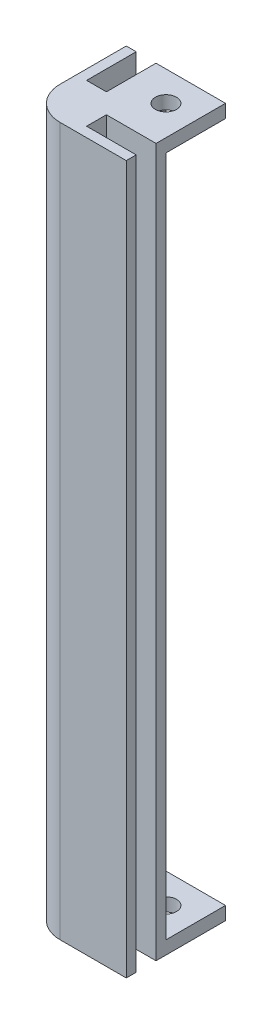
ISO-10303-21;
HEADER;
FILE_DESCRIPTION(('STEP AP214'),'2;1');
FILE_NAME('part.step','',(''),(''),'','','');
FILE_SCHEMA(('AUTOMOTIVE_DESIGN { 1 0 10303 214 1 1 1 1 }'));
ENDSEC;
DATA;
#1=APPLICATION_CONTEXT('core data for automotive mechanical design processes');
#2=APPLICATION_PROTOCOL_DEFINITION('international standard','automotive_design',2000,#1);
#3=PRODUCT_CONTEXT('',#1,'mechanical');
#4=PRODUCT('Part','Part','',(#3));
#5=PRODUCT_RELATED_PRODUCT_CATEGORY('part','',(#4));
#6=PRODUCT_DEFINITION_FORMATION('','',#4);
#7=PRODUCT_DEFINITION_CONTEXT('part definition',#1,'design');
#8=PRODUCT_DEFINITION('design','',#6,#7);
#9=PRODUCT_DEFINITION_SHAPE('','',#8);
#10=(LENGTH_UNIT() NAMED_UNIT(*) SI_UNIT(.MILLI.,.METRE.));
#11=(NAMED_UNIT(*) PLANE_ANGLE_UNIT() SI_UNIT($,.RADIAN.));
#12=(NAMED_UNIT(*) SI_UNIT($,.STERADIAN.) SOLID_ANGLE_UNIT());
#13=UNCERTAINTY_MEASURE_WITH_UNIT(LENGTH_MEASURE(1.E-05),#10,'distance_accuracy_value','');
#14=(GEOMETRIC_REPRESENTATION_CONTEXT(3) GLOBAL_UNCERTAINTY_ASSIGNED_CONTEXT((#13)) GLOBAL_UNIT_ASSIGNED_CONTEXT((#10,
#11,#12)) REPRESENTATION_CONTEXT('',''));
#15=CARTESIAN_POINT('',(0.,0.,0.));
#16=DIRECTION('',(0.,0.,1.));
#17=DIRECTION('',(1.,0.,0.));
#18=AXIS2_PLACEMENT_3D('',#15,#16,#17);
#19=CARTESIAN_POINT('',(-7.49999999999998,105.,7.50000000000001));
#20=DIRECTION('',(1.,0.,0.));
#21=DIRECTION('',(0.,0.,-1.));
#22=AXIS2_PLACEMENT_3D('',#19,#20,#21);
#23=PLANE('',#22);
#24=DIRECTION('',(0.,0.,-1.));
#25=VECTOR('',#24,1.);
#26=CARTESIAN_POINT('',(-7.49999999999999,-2.,0.));
#27=LINE('',#26,#25);
#28=CARTESIAN_POINT('',(-7.49999999999999,-2.,2.50000000000002));
#29=VERTEX_POINT('',#28);
#30=CARTESIAN_POINT('',(-7.50000000000001,-2.,-7.49999999999999));
#31=VERTEX_POINT('',#30);
#32=EDGE_CURVE('E293',#29,#31,#27,.T.);
#33=ORIENTED_EDGE('',*,*,#32,.F.);
#34=DIRECTION('',(0.,-1.,0.));
#35=VECTOR('',#34,1.);
#36=CARTESIAN_POINT('',(-7.49999999999999,105.,2.50000000000002));
#37=LINE('',#36,#35);
#38=CARTESIAN_POINT('',(-7.49999999999999,105.,2.50000000000002));
#39=VERTEX_POINT('',#38);
#40=EDGE_CURVE('E185',#29,#39,#37,.F.);
#41=ORIENTED_EDGE('',*,*,#40,.T.);
#42=DIRECTION('',(0.,0.,1.));
#43=VECTOR('',#42,1.);
#44=CARTESIAN_POINT('',(-7.49999999999998,105.,7.50000000000001));
#45=LINE('',#44,#43);
#46=CARTESIAN_POINT('',(-7.50000000000001,105.,-7.49999999999999));
#47=VERTEX_POINT('',#46);
#48=EDGE_CURVE('E221',#47,#39,#45,.T.);
#49=ORIENTED_EDGE('',*,*,#48,.F.);
#50=DIRECTION('',(0.,-1.,0.));
#51=VECTOR('',#50,1.);
#52=CARTESIAN_POINT('',(-7.50000000000001,105.,-7.49999999999999));
#53=LINE('',#52,#51);
#54=EDGE_CURVE('E215',#47,#31,#53,.T.);
#55=ORIENTED_EDGE('',*,*,#54,.T.);
#56=EDGE_LOOP('',(#33,#41,#49,#55));
#57=FACE_BOUND('',#56,.T.);
#58=ADVANCED_FACE('F42',(#57),#23,.F.);
#59=CARTESIAN_POINT('',(-7.49999999999998,105.,7.50000000000001));
#60=DIRECTION('',(0.,0.,-1.));
#61=DIRECTION('',(-1.,0.,0.));
#62=AXIS2_PLACEMENT_3D('',#59,#60,#61);
#63=PLANE('',#62);
#64=DIRECTION('',(1.,0.,0.));
#65=VECTOR('',#64,1.);
#66=CARTESIAN_POINT('',(-7.49999999999998,105.,7.50000000000001));
#67=LINE('',#66,#65);
#68=CARTESIAN_POINT('',(-2.49999999999999,105.,7.50000000000001));
#69=VERTEX_POINT('',#68);
#70=CARTESIAN_POINT('',(7.50000000000002,105.,7.50000000000001));
#71=VERTEX_POINT('',#70);
#72=EDGE_CURVE('E245',#69,#71,#67,.T.);
#73=ORIENTED_EDGE('',*,*,#72,.F.);
#74=DIRECTION('',(0.,-1.,0.));
#75=VECTOR('',#74,1.);
#76=CARTESIAN_POINT('',(-2.49999999999999,105.,7.50000000000001));
#77=LINE('',#76,#75);
#78=CARTESIAN_POINT('',(-2.49999999999999,-2.,7.50000000000001));
#79=VERTEX_POINT('',#78);
#80=EDGE_CURVE('E191',#69,#79,#77,.T.);
#81=ORIENTED_EDGE('',*,*,#80,.T.);
#82=DIRECTION('',(-1.,0.,0.));
#83=VECTOR('',#82,1.);
#84=CARTESIAN_POINT('',(0.,-2.,7.50000000000001));
#85=LINE('',#84,#83);
#86=CARTESIAN_POINT('',(7.50000000000002,-2.,7.50000000000001));
#87=VERTEX_POINT('',#86);
#88=EDGE_CURVE('E255',#87,#79,#85,.T.);
#89=ORIENTED_EDGE('',*,*,#88,.F.);
#90=DIRECTION('',(0.,-1.,0.));
#91=VECTOR('',#90,1.);
#92=CARTESIAN_POINT('',(7.50000000000002,105.,7.50000000000001));
#93=LINE('',#92,#91);
#94=EDGE_CURVE('E194',#71,#87,#93,.T.);
#95=ORIENTED_EDGE('',*,*,#94,.F.);
#96=EDGE_LOOP('',(#73,#81,#89,#95));
#97=FACE_BOUND('',#96,.T.);
#98=ADVANCED_FACE('F335',(#97),#63,.F.);
#99=CARTESIAN_POINT('',(7.50000000000002,105.,7.50000000000001));
#100=DIRECTION('',(-1.,0.,0.));
#101=DIRECTION('',(0.,0.,1.));
#102=AXIS2_PLACEMENT_3D('',#99,#100,#101);
#103=PLANE('',#102);
#104=ORIENTED_EDGE('',*,*,#94,.T.);
#105=DIRECTION('',(0.,0.,1.));
#106=VECTOR('',#105,1.);
#107=CARTESIAN_POINT('',(7.50000000000002,-2.,0.));
#108=LINE('',#107,#106);
#109=CARTESIAN_POINT('',(7.50000000000002,-2.,6.00000000000001));
#110=VERTEX_POINT('',#109);
#111=EDGE_CURVE('E264',#110,#87,#108,.T.);
#112=ORIENTED_EDGE('',*,*,#111,.F.);
#113=DIRECTION('',(0.,-1.,0.));
#114=VECTOR('',#113,1.);
#115=CARTESIAN_POINT('',(7.50000000000002,105.,6.00000000000001));
#116=LINE('',#115,#114);
#117=CARTESIAN_POINT('',(7.50000000000002,105.,6.00000000000001));
#118=VERTEX_POINT('',#117);
#119=EDGE_CURVE('E196',#118,#110,#116,.T.);
#120=ORIENTED_EDGE('',*,*,#119,.F.);
#121=DIRECTION('',(0.,0.,-1.));
#122=VECTOR('',#121,1.);
#123=CARTESIAN_POINT('',(7.50000000000002,105.,7.50000000000001));
#124=LINE('',#123,#122);
#125=EDGE_CURVE('E243',#71,#118,#124,.T.);
#126=ORIENTED_EDGE('',*,*,#125,.F.);
#127=EDGE_LOOP('',(#104,#112,#120,#126));
#128=FACE_BOUND('',#127,.T.);
#129=ADVANCED_FACE('F341',(#128),#103,.F.);
#130=CARTESIAN_POINT('',(7.50000000000002,105.,6.00000000000001));
#131=DIRECTION('',(0.,0.,1.));
#132=DIRECTION('',(1.,0.,0.));
#133=AXIS2_PLACEMENT_3D('',#130,#131,#132);
#134=PLANE('',#133);
#135=ORIENTED_EDGE('',*,*,#119,.T.);
#136=DIRECTION('',(1.,0.,0.));
#137=VECTOR('',#136,1.);
#138=CARTESIAN_POINT('',(0.,-2.,6.00000000000001));
#139=LINE('',#138,#137);
#140=CARTESIAN_POINT('',(0.,-2.,6.00000000000001));
#141=VERTEX_POINT('',#140);
#142=EDGE_CURVE('E267',#141,#110,#139,.T.);
#143=ORIENTED_EDGE('',*,*,#142,.F.);
#144=DIRECTION('',(0.,-1.,0.));
#145=VECTOR('',#144,1.);
#146=CARTESIAN_POINT('',(0.,105.,6.00000000000001));
#147=LINE('',#146,#145);
#148=CARTESIAN_POINT('',(0.,105.,6.00000000000001));
#149=VERTEX_POINT('',#148);
#150=EDGE_CURVE('E198',#149,#141,#147,.T.);
#151=ORIENTED_EDGE('',*,*,#150,.F.);
#152=DIRECTION('',(-1.,0.,0.));
#153=VECTOR('',#152,1.);
#154=CARTESIAN_POINT('',(7.50000000000002,105.,6.00000000000001));
#155=LINE('',#154,#153);
#156=EDGE_CURVE('E241',#118,#149,#155,.T.);
#157=ORIENTED_EDGE('',*,*,#156,.F.);
#158=EDGE_LOOP('',(#135,#143,#151,#157));
#159=FACE_BOUND('',#158,.T.);
#160=ADVANCED_FACE('F372',(#159),#134,.F.);
#161=CARTESIAN_POINT('',(0.,105.,6.00000000000001));
#162=DIRECTION('',(-1.,0.,0.));
#163=DIRECTION('',(0.,0.,1.));
#164=AXIS2_PLACEMENT_3D('',#161,#162,#163);
#165=PLANE('',#164);
#166=ORIENTED_EDGE('',*,*,#150,.T.);
#167=DIRECTION('',(0.,0.,1.));
#168=VECTOR('',#167,1.);
#169=CARTESIAN_POINT('',(0.,-2.,0.));
#170=LINE('',#169,#168);
#171=CARTESIAN_POINT('',(0.,-2.,3.));
#172=VERTEX_POINT('',#171);
#173=EDGE_CURVE('E270',#172,#141,#170,.T.);
#174=ORIENTED_EDGE('',*,*,#173,.F.);
#175=DIRECTION('',(0.,-1.,0.));
#176=VECTOR('',#175,1.);
#177=CARTESIAN_POINT('',(0.,105.,3.));
#178=LINE('',#177,#176);
#179=CARTESIAN_POINT('',(0.,105.,3.));
#180=VERTEX_POINT('',#179);
#181=EDGE_CURVE('E200',#180,#172,#178,.T.);
#182=ORIENTED_EDGE('',*,*,#181,.F.);
#183=DIRECTION('',(0.,0.,-1.));
#184=VECTOR('',#183,1.);
#185=CARTESIAN_POINT('',(0.,105.,6.00000000000001));
#186=LINE('',#185,#184);
#187=EDGE_CURVE('E239',#149,#180,#186,.T.);
#188=ORIENTED_EDGE('',*,*,#187,.F.);
#189=EDGE_LOOP('',(#166,#174,#182,#188));
#190=FACE_BOUND('',#189,.T.);
#191=ADVANCED_FACE('F375',(#190),#165,.F.);
#192=CARTESIAN_POINT('',(0.,105.,3.));
#193=DIRECTION('',(0.,0.,-1.));
#194=DIRECTION('',(-1.,0.,0.));
#195=AXIS2_PLACEMENT_3D('',#192,#193,#194);
#196=PLANE('',#195);
#197=ORIENTED_EDGE('',*,*,#181,.T.);
#198=DIRECTION('',(-1.,0.,0.));
#199=VECTOR('',#198,1.);
#200=CARTESIAN_POINT('',(0.,-2.,3.));
#201=LINE('',#200,#199);
#202=CARTESIAN_POINT('',(7.50000000000001,-2.,3.));
#203=VERTEX_POINT('',#202);
#204=EDGE_CURVE('E273',#203,#172,#201,.T.);
#205=ORIENTED_EDGE('',*,*,#204,.F.);
#206=DIRECTION('',(0.,-1.,0.));
#207=VECTOR('',#206,1.);
#208=CARTESIAN_POINT('',(7.50000000000001,105.,3.));
#209=LINE('',#208,#207);
#210=CARTESIAN_POINT('',(7.50000000000001,105.,3.));
#211=VERTEX_POINT('',#210);
#212=EDGE_CURVE('E202',#211,#203,#209,.T.);
#213=ORIENTED_EDGE('',*,*,#212,.F.);
#214=DIRECTION('',(1.,0.,0.));
#215=VECTOR('',#214,1.);
#216=CARTESIAN_POINT('',(0.,105.,3.));
#217=LINE('',#216,#215);
#218=EDGE_CURVE('E237',#180,#211,#217,.T.);
#219=ORIENTED_EDGE('',*,*,#218,.F.);
#220=EDGE_LOOP('',(#197,#205,#213,#219));
#221=FACE_BOUND('',#220,.T.);
#222=ADVANCED_FACE('F380',(#221),#196,.F.);
#223=CARTESIAN_POINT('',(7.50000000000001,105.,3.));
#224=DIRECTION('',(-1.,0.,0.));
#225=DIRECTION('',(0.,0.,1.));
#226=AXIS2_PLACEMENT_3D('',#223,#224,#225);
#227=PLANE('',#226);
#228=ORIENTED_EDGE('',*,*,#212,.T.);
#229=DIRECTION('',(0.,0.,1.));
#230=VECTOR('',#229,1.);
#231=CARTESIAN_POINT('',(7.50000000000001,-2.,0.));
#232=LINE('',#231,#230);
#233=CARTESIAN_POINT('',(7.50000000000001,-2.,-7.49999999999999));
#234=VERTEX_POINT('',#233);
#235=EDGE_CURVE('E276',#234,#203,#232,.T.);
#236=ORIENTED_EDGE('',*,*,#235,.F.);
#237=DIRECTION('',(0.,1.,0.));
#238=VECTOR('',#237,1.);
#239=CARTESIAN_POINT('',(7.50000000000001,-2.,-7.49999999999999));
#240=LINE('',#239,#238);
#241=CARTESIAN_POINT('',(7.50000000000001,0.,-7.49999999999999));
#242=VERTEX_POINT('',#241);
#243=EDGE_CURVE('E224',#234,#242,#240,.T.);
#244=ORIENTED_EDGE('',*,*,#243,.T.);
#245=DIRECTION('',(0.,0.,1.));
#246=VECTOR('',#245,1.);
#247=CARTESIAN_POINT('',(7.50000000000001,0.,0.));
#248=LINE('',#247,#246);
#249=CARTESIAN_POINT('',(7.50000000000001,0.,1.5));
#250=VERTEX_POINT('',#249);
#251=EDGE_CURVE('E256',#242,#250,#248,.T.);
#252=ORIENTED_EDGE('',*,*,#251,.T.);
#253=DIRECTION('',(0.,-1.,0.));
#254=VECTOR('',#253,1.);
#255=CARTESIAN_POINT('',(7.50000000000001,105.,1.5));
#256=LINE('',#255,#254);
#257=CARTESIAN_POINT('',(7.50000000000001,103.,1.5));
#258=VERTEX_POINT('',#257);
#259=EDGE_CURVE('E204',#258,#250,#256,.T.);
#260=ORIENTED_EDGE('',*,*,#259,.F.);
#261=DIRECTION('',(0.,0.,-1.));
#262=VECTOR('',#261,1.);
#263=CARTESIAN_POINT('',(7.50000000000001,103.,-7.49999999999999));
#264=LINE('',#263,#262);
#265=CARTESIAN_POINT('',(7.50000000000001,103.,-7.49999999999999));
#266=VERTEX_POINT('',#265);
#267=EDGE_CURVE('E301',#258,#266,#264,.T.);
#268=ORIENTED_EDGE('',*,*,#267,.T.);
#269=DIRECTION('',(0.,1.,0.));
#270=VECTOR('',#269,1.);
#271=CARTESIAN_POINT('',(7.50000000000001,103.,-7.49999999999999));
#272=LINE('',#271,#270);
#273=CARTESIAN_POINT('',(7.50000000000001,105.,-7.49999999999999));
#274=VERTEX_POINT('',#273);
#275=EDGE_CURVE('E261',#266,#274,#272,.T.);
#276=ORIENTED_EDGE('',*,*,#275,.T.);
#277=DIRECTION('',(0.,0.,-1.));
#278=VECTOR('',#277,1.);
#279=CARTESIAN_POINT('',(7.50000000000001,105.,3.));
#280=LINE('',#279,#278);
#281=EDGE_CURVE('E234',#211,#274,#280,.T.);
#282=ORIENTED_EDGE('',*,*,#281,.F.);
#283=EDGE_LOOP('',(#228,#236,#244,#252,#260,#268,#276,#282));
#284=FACE_BOUND('',#283,.T.);
#285=ADVANCED_FACE('F384',(#284),#227,.F.);
#286=CARTESIAN_POINT('',(7.50000000000001,105.,1.5));
#287=DIRECTION('',(0.,0.,1.));
#288=DIRECTION('',(1.,0.,0.));
#289=AXIS2_PLACEMENT_3D('',#286,#287,#288);
#290=PLANE('',#289);
#291=DIRECTION('',(0.,-1.,0.));
#292=VECTOR('',#291,1.);
#293=CARTESIAN_POINT('',(1.00000000000001,105.,1.5));
#294=LINE('',#293,#292);
#295=CARTESIAN_POINT('',(1.00000000000001,0.,1.5));
#296=VERTEX_POINT('',#295);
#297=CARTESIAN_POINT('',(1.00000000000001,103.,1.5));
#298=VERTEX_POINT('',#297);
#299=EDGE_CURVE('E11',#296,#298,#294,.F.);
#300=ORIENTED_EDGE('',*,*,#299,.T.);
#301=DIRECTION('',(1.,0.,0.));
#302=VECTOR('',#301,1.);
#303=CARTESIAN_POINT('',(7.50000000000001,103.,1.5));
#304=LINE('',#303,#302);
#305=EDGE_CURVE('E174',#298,#258,#304,.T.);
#306=ORIENTED_EDGE('',*,*,#305,.T.);
#307=ORIENTED_EDGE('',*,*,#259,.T.);
#308=DIRECTION('',(-1.,0.,0.));
#309=VECTOR('',#308,1.);
#310=CARTESIAN_POINT('',(7.50000000000001,0.,1.5));
#311=LINE('',#310,#309);
#312=EDGE_CURVE('E222',#250,#296,#311,.T.);
#313=ORIENTED_EDGE('',*,*,#312,.T.);
#314=EDGE_LOOP('',(#300,#306,#307,#313));
#315=FACE_BOUND('',#314,.T.);
#316=ADVANCED_FACE('F414',(#315),#290,.F.);
#317=CARTESIAN_POINT('',(-1.5,105.,-7.49999999999999));
#318=DIRECTION('',(-1.,0.,0.));
#319=DIRECTION('',(0.,0.,1.));
#320=AXIS2_PLACEMENT_3D('',#317,#318,#319);
#321=PLANE('',#320);
#322=DIRECTION('',(0.,-1.,0.));
#323=VECTOR('',#322,1.);
#324=CARTESIAN_POINT('',(-1.5,105.,-7.49999999999999));
#325=LINE('',#324,#323);
#326=CARTESIAN_POINT('',(-1.5,103.,-7.49999999999999));
#327=VERTEX_POINT('',#326);
#328=CARTESIAN_POINT('',(-1.49999999999999,0.,-7.49999999999999));
#329=VERTEX_POINT('',#328);
#330=EDGE_CURVE('E180',#327,#329,#325,.T.);
#331=ORIENTED_EDGE('',*,*,#330,.F.);
#332=DIRECTION('',(0.,0.,1.));
#333=VECTOR('',#332,1.);
#334=CARTESIAN_POINT('',(-1.49999999999999,103.,-0.999999999999996));
#335=LINE('',#334,#333);
#336=CARTESIAN_POINT('',(-1.49999999999999,103.,-0.999999999999994));
#337=VERTEX_POINT('',#336);
#338=EDGE_CURVE('E171',#327,#337,#335,.T.);
#339=ORIENTED_EDGE('',*,*,#338,.T.);
#340=DIRECTION('',(0.,-1.,0.));
#341=VECTOR('',#340,1.);
#342=CARTESIAN_POINT('',(-1.49999999999999,0.,-0.999999999999995));
#343=LINE('',#342,#341);
#344=CARTESIAN_POINT('',(-1.49999999999999,0.,-0.999999999999996));
#345=VERTEX_POINT('',#344);
#346=EDGE_CURVE('E64',#337,#345,#343,.T.);
#347=ORIENTED_EDGE('',*,*,#346,.T.);
#348=DIRECTION('',(0.,0.,-1.));
#349=VECTOR('',#348,1.);
#350=CARTESIAN_POINT('',(-1.5,0.,-7.49999999999999));
#351=LINE('',#350,#349);
#352=EDGE_CURVE('E219',#345,#329,#351,.T.);
#353=ORIENTED_EDGE('',*,*,#352,.T.);
#354=EDGE_LOOP('',(#331,#339,#347,#353));
#355=FACE_BOUND('',#354,.T.);
#356=ADVANCED_FACE('F179',(#355),#321,.F.);
#357=CARTESIAN_POINT('',(-2.99999999999999,105.,-7.49999999999999));
#358=DIRECTION('',(0.,0.,1.));
#359=DIRECTION('',(1.,0.,0.));
#360=AXIS2_PLACEMENT_3D('',#357,#358,#359);
#361=PLANE('',#360);
#362=DIRECTION('',(-1.,0.,0.));
#363=VECTOR('',#362,1.);
#364=CARTESIAN_POINT('',(-2.99999999999999,105.,-7.49999999999999));
#365=LINE('',#364,#363);
#366=CARTESIAN_POINT('',(-2.99999999999999,105.,-7.49999999999999));
#367=VERTEX_POINT('',#366);
#368=EDGE_CURVE('E232',#274,#367,#365,.T.);
#369=ORIENTED_EDGE('',*,*,#368,.F.);
#370=ORIENTED_EDGE('',*,*,#275,.F.);
#371=DIRECTION('',(-1.,0.,0.));
#372=VECTOR('',#371,1.);
#373=CARTESIAN_POINT('',(-1.5,103.,-7.49999999999999));
#374=LINE('',#373,#372);
#375=EDGE_CURVE('E299',#266,#327,#374,.T.);
#376=ORIENTED_EDGE('',*,*,#375,.T.);
#377=ORIENTED_EDGE('',*,*,#330,.T.);
#378=DIRECTION('',(1.,0.,0.));
#379=VECTOR('',#378,1.);
#380=CARTESIAN_POINT('',(0.,0.,-7.49999999999999));
#381=LINE('',#380,#379);
#382=EDGE_CURVE('E259',#329,#242,#381,.T.);
#383=ORIENTED_EDGE('',*,*,#382,.T.);
#384=ORIENTED_EDGE('',*,*,#243,.F.);
#385=DIRECTION('',(1.,0.,0.));
#386=VECTOR('',#385,1.);
#387=CARTESIAN_POINT('',(0.,-2.,-7.49999999999999));
#388=LINE('',#387,#386);
#389=CARTESIAN_POINT('',(-2.99999999999999,-2.,-7.49999999999999));
#390=VERTEX_POINT('',#389);
#391=EDGE_CURVE('E279',#390,#234,#388,.T.);
#392=ORIENTED_EDGE('',*,*,#391,.F.);
#393=DIRECTION('',(0.,-1.,0.));
#394=VECTOR('',#393,1.);
#395=CARTESIAN_POINT('',(-2.99999999999999,105.,-7.49999999999999));
#396=LINE('',#395,#394);
#397=EDGE_CURVE('E207',#367,#390,#396,.T.);
#398=ORIENTED_EDGE('',*,*,#397,.F.);
#399=EDGE_LOOP('',(#369,#370,#376,#377,#383,#384,#392,#398));
#400=FACE_BOUND('',#399,.T.);
#401=ADVANCED_FACE('F387',(#400),#361,.F.);
#402=CARTESIAN_POINT('',(-2.99999999999999,105.,0.));
#403=DIRECTION('',(1.,0.,0.));
#404=DIRECTION('',(0.,0.,-1.));
#405=AXIS2_PLACEMENT_3D('',#402,#403,#404);
#406=PLANE('',#405);
#407=ORIENTED_EDGE('',*,*,#397,.T.);
#408=DIRECTION('',(0.,0.,-1.));
#409=VECTOR('',#408,1.);
#410=CARTESIAN_POINT('',(-2.99999999999999,-2.,0.));
#411=LINE('',#410,#409);
#412=CARTESIAN_POINT('',(-2.99999999999999,-2.,0.));
#413=VERTEX_POINT('',#412);
#414=EDGE_CURVE('E281',#413,#390,#411,.T.);
#415=ORIENTED_EDGE('',*,*,#414,.F.);
#416=DIRECTION('',(0.,-1.,0.));
#417=VECTOR('',#416,1.);
#418=CARTESIAN_POINT('',(-2.99999999999999,105.,0.));
#419=LINE('',#418,#417);
#420=CARTESIAN_POINT('',(-2.99999999999999,105.,0.));
#421=VERTEX_POINT('',#420);
#422=EDGE_CURVE('E209',#421,#413,#419,.T.);
#423=ORIENTED_EDGE('',*,*,#422,.F.);
#424=DIRECTION('',(0.,0.,1.));
#425=VECTOR('',#424,1.);
#426=CARTESIAN_POINT('',(-2.99999999999999,105.,0.));
#427=LINE('',#426,#425);
#428=EDGE_CURVE('E230',#367,#421,#427,.T.);
#429=ORIENTED_EDGE('',*,*,#428,.F.);
#430=EDGE_LOOP('',(#407,#415,#423,#429));
#431=FACE_BOUND('',#430,.T.);
#432=ADVANCED_FACE('F394',(#431),#406,.F.);
#433=CARTESIAN_POINT('',(-6.00000000000001,105.,0.));
#434=DIRECTION('',(0.,0.,1.));
#435=DIRECTION('',(1.,0.,0.));
#436=AXIS2_PLACEMENT_3D('',#433,#434,#435);
#437=PLANE('',#436);
#438=ORIENTED_EDGE('',*,*,#422,.T.);
#439=DIRECTION('',(1.,0.,0.));
#440=VECTOR('',#439,1.);
#441=CARTESIAN_POINT('',(0.,-2.,0.));
#442=LINE('',#441,#440);
#443=CARTESIAN_POINT('',(-6.00000000000001,-2.,0.));
#444=VERTEX_POINT('',#443);
#445=EDGE_CURVE('E284',#444,#413,#442,.T.);
#446=ORIENTED_EDGE('',*,*,#445,.F.);
#447=DIRECTION('',(0.,-1.,0.));
#448=VECTOR('',#447,1.);
#449=CARTESIAN_POINT('',(-6.00000000000001,105.,0.));
#450=LINE('',#449,#448);
#451=CARTESIAN_POINT('',(-6.00000000000001,105.,0.));
#452=VERTEX_POINT('',#451);
#453=EDGE_CURVE('E211',#452,#444,#450,.T.);
#454=ORIENTED_EDGE('',*,*,#453,.F.);
#455=DIRECTION('',(-1.,0.,0.));
#456=VECTOR('',#455,1.);
#457=CARTESIAN_POINT('',(-6.00000000000001,105.,0.));
#458=LINE('',#457,#456);
#459=EDGE_CURVE('E228',#421,#452,#458,.T.);
#460=ORIENTED_EDGE('',*,*,#459,.F.);
#461=EDGE_LOOP('',(#438,#446,#454,#460));
#462=FACE_BOUND('',#461,.T.);
#463=ADVANCED_FACE('F401',(#462),#437,.F.);
#464=CARTESIAN_POINT('',(-6.00000000000001,105.,-7.49999999999999));
#465=DIRECTION('',(-1.,0.,0.));
#466=DIRECTION('',(0.,0.,1.));
#467=AXIS2_PLACEMENT_3D('',#464,#465,#466);
#468=PLANE('',#467);
#469=ORIENTED_EDGE('',*,*,#453,.T.);
#470=DIRECTION('',(0.,0.,1.));
#471=VECTOR('',#470,1.);
#472=CARTESIAN_POINT('',(-6.00000000000001,-2.,0.));
#473=LINE('',#472,#471);
#474=CARTESIAN_POINT('',(-6.00000000000001,-2.,-7.49999999999999));
#475=VERTEX_POINT('',#474);
#476=EDGE_CURVE('E287',#475,#444,#473,.T.);
#477=ORIENTED_EDGE('',*,*,#476,.F.);
#478=DIRECTION('',(0.,-1.,0.));
#479=VECTOR('',#478,1.);
#480=CARTESIAN_POINT('',(-6.00000000000001,105.,-7.49999999999999));
#481=LINE('',#480,#479);
#482=CARTESIAN_POINT('',(-6.00000000000001,105.,-7.49999999999999));
#483=VERTEX_POINT('',#482);
#484=EDGE_CURVE('E213',#483,#475,#481,.T.);
#485=ORIENTED_EDGE('',*,*,#484,.F.);
#486=DIRECTION('',(0.,0.,-1.));
#487=VECTOR('',#486,1.);
#488=CARTESIAN_POINT('',(-6.00000000000001,105.,-7.49999999999999));
#489=LINE('',#488,#487);
#490=EDGE_CURVE('E226',#452,#483,#489,.T.);
#491=ORIENTED_EDGE('',*,*,#490,.F.);
#492=EDGE_LOOP('',(#469,#477,#485,#491));
#493=FACE_BOUND('',#492,.T.);
#494=ADVANCED_FACE('F331',(#493),#468,.F.);
#495=CARTESIAN_POINT('',(-7.50000000000001,105.,-7.49999999999999));
#496=DIRECTION('',(0.,0.,1.));
#497=DIRECTION('',(1.,0.,0.));
#498=AXIS2_PLACEMENT_3D('',#495,#496,#497);
#499=PLANE('',#498);
#500=ORIENTED_EDGE('',*,*,#484,.T.);
#501=DIRECTION('',(1.,0.,0.));
#502=VECTOR('',#501,1.);
#503=CARTESIAN_POINT('',(0.,-2.,-7.49999999999999));
#504=LINE('',#503,#502);
#505=EDGE_CURVE('E290',#31,#475,#504,.T.);
#506=ORIENTED_EDGE('',*,*,#505,.F.);
#507=ORIENTED_EDGE('',*,*,#54,.F.);
#508=DIRECTION('',(-1.,0.,0.));
#509=VECTOR('',#508,1.);
#510=CARTESIAN_POINT('',(-7.50000000000001,105.,-7.49999999999999));
#511=LINE('',#510,#509);
#512=EDGE_CURVE('E218',#483,#47,#511,.T.);
#513=ORIENTED_EDGE('',*,*,#512,.F.);
#514=EDGE_LOOP('',(#500,#506,#507,#513));
#515=FACE_BOUND('',#514,.T.);
#516=ADVANCED_FACE('F321',(#515),#499,.F.);
#517=CARTESIAN_POINT('',(0.,105.,0.));
#518=DIRECTION('',(0.,-1.,0.));
#519=DIRECTION('',(0.,0.,-1.));
#520=AXIS2_PLACEMENT_3D('',#517,#518,#519);
#521=PLANE('',#520);
#522=ORIENTED_EDGE('',*,*,#281,.T.);
#523=ORIENTED_EDGE('',*,*,#368,.T.);
#524=ORIENTED_EDGE('',*,*,#428,.T.);
#525=ORIENTED_EDGE('',*,*,#459,.T.);
#526=ORIENTED_EDGE('',*,*,#490,.T.);
#527=ORIENTED_EDGE('',*,*,#512,.T.);
#528=ORIENTED_EDGE('',*,*,#48,.T.);
#529=CARTESIAN_POINT('',(-2.49999999999999,105.,2.50000000000001));
#530=DIRECTION('',(0.,-1.,0.));
#531=DIRECTION('',(0.,0.,-1.));
#532=AXIS2_PLACEMENT_3D('',#529,#530,#531);
#533=CIRCLE('',#532,5.);
#534=EDGE_CURVE('E183',#39,#69,#533,.F.);
#535=ORIENTED_EDGE('',*,*,#534,.T.);
#536=ORIENTED_EDGE('',*,*,#72,.T.);
#537=ORIENTED_EDGE('',*,*,#125,.T.);
#538=ORIENTED_EDGE('',*,*,#156,.T.);
#539=ORIENTED_EDGE('',*,*,#187,.T.);
#540=ORIENTED_EDGE('',*,*,#218,.T.);
#541=EDGE_LOOP('',(#522,#523,#524,#525,#526,#527,#528,#535,#536,#537,#538,#539,#540));
#542=FACE_BOUND('',#541,.T.);
#543=CARTESIAN_POINT('',(3.00000000000001,105.,-3.));
#544=DIRECTION('',(0.,1.,0.));
#545=DIRECTION('',(0.,0.,1.));
#546=AXIS2_PLACEMENT_3D('',#543,#544,#545);
#547=CIRCLE('',#546,1.6);
#548=CARTESIAN_POINT('',(3.00000000000001,105.,-1.4));
#549=VERTEX_POINT('',#548);
#550=EDGE_CURVE('E305',#549,#549,#547,.T.);
#551=ORIENTED_EDGE('',*,*,#550,.F.);
#552=EDGE_LOOP('',(#551));
#553=FACE_BOUND('',#552,.T.);
#554=ADVANCED_FACE('F318',(#542,#553),#521,.F.);
#555=CARTESIAN_POINT('',(3.00000000000001,-2.,-3.));
#556=DIRECTION('',(0.,1.,0.));
#557=DIRECTION('',(0.,0.,1.));
#558=AXIS2_PLACEMENT_3D('',#555,#556,#557);
#559=CYLINDRICAL_SURFACE('',#558,1.6);
#560=CARTESIAN_POINT('',(3.00000000000001,-2.,-3.));
#561=DIRECTION('',(0.,-1.,0.));
#562=DIRECTION('',(0.,0.,-1.));
#563=AXIS2_PLACEMENT_3D('',#560,#561,#562);
#564=CIRCLE('',#563,1.6);
#565=CARTESIAN_POINT('',(3.00000000000001,-2.,-4.6));
#566=VERTEX_POINT('',#565);
#567=EDGE_CURVE('E251',#566,#566,#564,.T.);
#568=ORIENTED_EDGE('',*,*,#567,.T.);
#569=EDGE_LOOP('',(#568));
#570=FACE_BOUND('',#569,.T.);
#571=CARTESIAN_POINT('',(3.00000000000001,0.,-3.));
#572=DIRECTION('',(0.,-1.,0.));
#573=DIRECTION('',(0.,0.,-1.));
#574=AXIS2_PLACEMENT_3D('',#571,#572,#573);
#575=CIRCLE('',#574,1.6);
#576=CARTESIAN_POINT('',(3.00000000000001,0.,-4.6));
#577=VERTEX_POINT('',#576);
#578=EDGE_CURVE('E252',#577,#577,#575,.T.);
#579=ORIENTED_EDGE('',*,*,#578,.F.);
#580=EDGE_LOOP('',(#579));
#581=FACE_BOUND('',#580,.T.);
#582=ADVANCED_FACE('F320',(#570,#581),#559,.F.);
#583=CARTESIAN_POINT('',(0.,-2.,0.));
#584=DIRECTION('',(0.,-1.,0.));
#585=DIRECTION('',(0.,0.,-1.));
#586=AXIS2_PLACEMENT_3D('',#583,#584,#585);
#587=PLANE('',#586);
#588=ORIENTED_EDGE('',*,*,#88,.T.);
#589=CARTESIAN_POINT('',(-2.49999999999999,-2.,2.50000000000001));
#590=DIRECTION('',(0.,-1.,0.));
#591=DIRECTION('',(0.,0.,-1.));
#592=AXIS2_PLACEMENT_3D('',#589,#590,#591);
#593=CIRCLE('',#592,5.);
#594=EDGE_CURVE('E189',#79,#29,#593,.T.);
#595=ORIENTED_EDGE('',*,*,#594,.T.);
#596=ORIENTED_EDGE('',*,*,#32,.T.);
#597=ORIENTED_EDGE('',*,*,#505,.T.);
#598=ORIENTED_EDGE('',*,*,#476,.T.);
#599=ORIENTED_EDGE('',*,*,#445,.T.);
#600=ORIENTED_EDGE('',*,*,#414,.T.);
#601=ORIENTED_EDGE('',*,*,#391,.T.);
#602=ORIENTED_EDGE('',*,*,#235,.T.);
#603=ORIENTED_EDGE('',*,*,#204,.T.);
#604=ORIENTED_EDGE('',*,*,#173,.T.);
#605=ORIENTED_EDGE('',*,*,#142,.T.);
#606=ORIENTED_EDGE('',*,*,#111,.T.);
#607=EDGE_LOOP('',(#588,#595,#596,#597,#598,#599,#600,#601,#602,#603,#604,#605,#606));
#608=FACE_BOUND('',#607,.T.);
#609=ORIENTED_EDGE('',*,*,#567,.F.);
#610=EDGE_LOOP('',(#609));
#611=FACE_BOUND('',#610,.T.);
#612=ADVANCED_FACE('F328',(#608,#611),#587,.T.);
#613=CARTESIAN_POINT('',(0.,0.,0.));
#614=DIRECTION('',(0.,-1.,0.));
#615=DIRECTION('',(0.,0.,-1.));
#616=AXIS2_PLACEMENT_3D('',#613,#614,#615);
#617=PLANE('',#616);
#618=ORIENTED_EDGE('',*,*,#352,.F.);
#619=CARTESIAN_POINT('',(1.00000000000001,0.,-0.999999999999999));
#620=DIRECTION('',(0.,-1.,0.));
#621=DIRECTION('',(0.,0.,-1.));
#622=AXIS2_PLACEMENT_3D('',#619,#620,#621);
#623=CIRCLE('',#622,2.5);
#624=EDGE_CURVE('E50',#345,#296,#623,.F.);
#625=ORIENTED_EDGE('',*,*,#624,.T.);
#626=ORIENTED_EDGE('',*,*,#312,.F.);
#627=ORIENTED_EDGE('',*,*,#251,.F.);
#628=ORIENTED_EDGE('',*,*,#382,.F.);
#629=EDGE_LOOP('',(#618,#625,#626,#627,#628));
#630=FACE_BOUND('',#629,.T.);
#631=ORIENTED_EDGE('',*,*,#578,.T.);
#632=EDGE_LOOP('',(#631));
#633=FACE_BOUND('',#632,.T.);
#634=ADVANCED_FACE('F348',(#630,#633),#617,.F.);
#635=CARTESIAN_POINT('',(-2.49999999999999,105.,2.50000000000001));
#636=DIRECTION('',(0.,-1.,0.));
#637=DIRECTION('',(0.,0.,-1.));
#638=AXIS2_PLACEMENT_3D('',#635,#636,#637);
#639=CYLINDRICAL_SURFACE('',#638,5.);
#640=ORIENTED_EDGE('',*,*,#534,.F.);
#641=ORIENTED_EDGE('',*,*,#40,.F.);
#642=ORIENTED_EDGE('',*,*,#594,.F.);
#643=ORIENTED_EDGE('',*,*,#80,.F.);
#644=EDGE_LOOP('',(#640,#641,#642,#643));
#645=FACE_BOUND('',#644,.T.);
#646=ADVANCED_FACE('F346',(#645),#639,.T.);
#647=CARTESIAN_POINT('',(1.00000000000001,105.,-0.999999999999999));
#648=DIRECTION('',(0.,1.,0.));
#649=DIRECTION('',(0.,0.,1.));
#650=AXIS2_PLACEMENT_3D('',#647,#648,#649);
#651=CYLINDRICAL_SURFACE('',#650,2.5);
#652=ORIENTED_EDGE('',*,*,#346,.F.);
#653=CARTESIAN_POINT('',(1.00000000000001,103.,-0.999999999999999));
#654=DIRECTION('',(0.,1.,0.));
#655=DIRECTION('',(0.,0.,-1.));
#656=AXIS2_PLACEMENT_3D('',#653,#654,#655);
#657=CIRCLE('',#656,2.5);
#658=EDGE_CURVE('E168',#337,#298,#657,.T.);
#659=ORIENTED_EDGE('',*,*,#658,.T.);
#660=ORIENTED_EDGE('',*,*,#299,.F.);
#661=ORIENTED_EDGE('',*,*,#624,.F.);
#662=EDGE_LOOP('',(#652,#659,#660,#661));
#663=FACE_BOUND('',#662,.T.);
#664=ADVANCED_FACE('F44',(#663),#651,.F.);
#665=CARTESIAN_POINT('',(1.00000000000001,103.,-0.999999999999999));
#666=DIRECTION('',(0.,-1.,0.));
#667=DIRECTION('',(0.,0.,-1.));
#668=AXIS2_PLACEMENT_3D('',#665,#666,#667);
#669=PLANE('',#668);
#670=CARTESIAN_POINT('',(3.00000000000001,103.,-3.));
#671=DIRECTION('',(0.,1.,0.));
#672=DIRECTION('',(0.,0.,1.));
#673=AXIS2_PLACEMENT_3D('',#670,#671,#672);
#674=CIRCLE('',#673,1.6);
#675=CARTESIAN_POINT('',(3.00000000000001,103.,-1.4));
#676=VERTEX_POINT('',#675);
#677=EDGE_CURVE('E181',#676,#676,#674,.T.);
#678=ORIENTED_EDGE('',*,*,#677,.T.);
#679=EDGE_LOOP('',(#678));
#680=FACE_BOUND('',#679,.T.);
#681=ORIENTED_EDGE('',*,*,#338,.F.);
#682=ORIENTED_EDGE('',*,*,#375,.F.);
#683=ORIENTED_EDGE('',*,*,#267,.F.);
#684=ORIENTED_EDGE('',*,*,#305,.F.);
#685=ORIENTED_EDGE('',*,*,#658,.F.);
#686=EDGE_LOOP('',(#681,#682,#683,#684,#685));
#687=FACE_BOUND('',#686,.T.);
#688=ADVANCED_FACE('F169',(#680,#687),#669,.T.);
#689=CARTESIAN_POINT('',(3.00000000000001,103.,-3.));
#690=DIRECTION('',(0.,1.,0.));
#691=DIRECTION('',(0.,0.,1.));
#692=AXIS2_PLACEMENT_3D('',#689,#690,#691);
#693=CYLINDRICAL_SURFACE('',#692,1.6);
#694=ORIENTED_EDGE('',*,*,#677,.F.);
#695=EDGE_LOOP('',(#694));
#696=FACE_BOUND('',#695,.T.);
#697=ORIENTED_EDGE('',*,*,#550,.T.);
#698=EDGE_LOOP('',(#697));
#699=FACE_BOUND('',#698,.T.);
#700=ADVANCED_FACE('F312',(#696,#699),#693,.F.);
#701=CLOSED_SHELL('',(#58,#98,#129,#160,#191,#222,#285,#316,#356,#401,#432,#463,#494,#516,#554,
#582,#612,#634,#646,#664,#688,#700));
#702=MANIFOLD_SOLID_BREP('B2',#701);
#703=ADVANCED_BREP_SHAPE_REPRESENTATION('',(#18,#702),#14);
#704=SHAPE_DEFINITION_REPRESENTATION(#9,#703);
ENDSEC;
END-ISO-10303-21;
